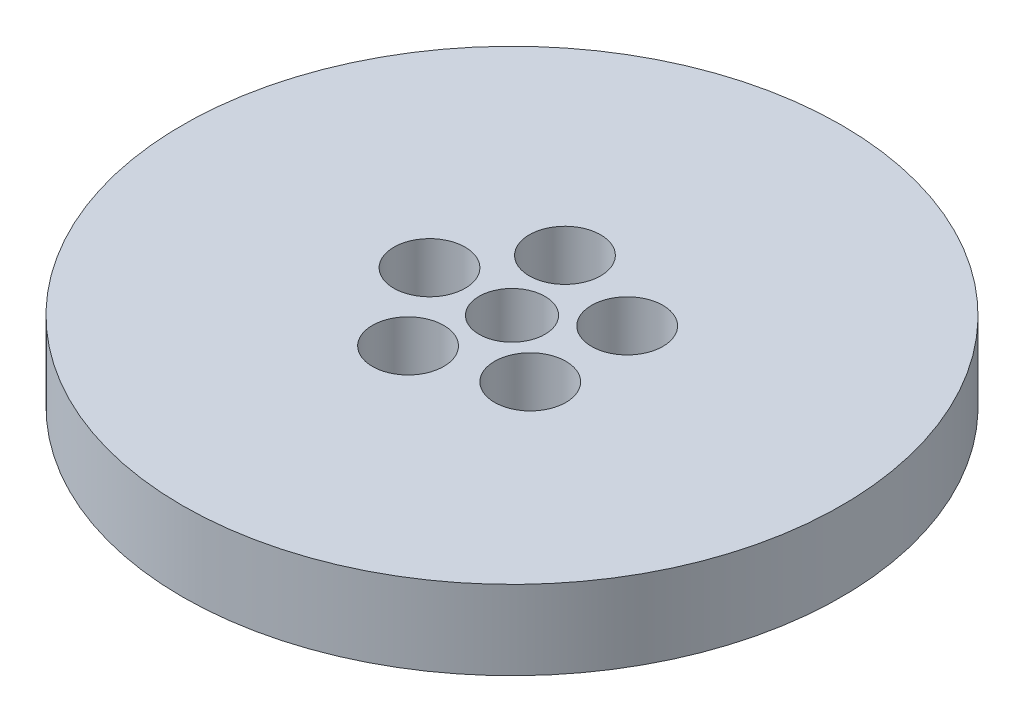
ISO-10303-21;
HEADER;
FILE_DESCRIPTION(('STEP AP214'),'2;1');
FILE_NAME('part.step','',(''),(''),'','','');
FILE_SCHEMA(('AUTOMOTIVE_DESIGN { 1 0 10303 214 1 1 1 1 }'));
ENDSEC;
DATA;
#1=APPLICATION_CONTEXT('core data for automotive mechanical design processes');
#2=APPLICATION_PROTOCOL_DEFINITION('international standard','automotive_design',2000,#1);
#3=PRODUCT_CONTEXT('',#1,'mechanical');
#4=PRODUCT('Part','Part','',(#3));
#5=PRODUCT_RELATED_PRODUCT_CATEGORY('part','',(#4));
#6=PRODUCT_DEFINITION_FORMATION('','',#4);
#7=PRODUCT_DEFINITION_CONTEXT('part definition',#1,'design');
#8=PRODUCT_DEFINITION('design','',#6,#7);
#9=PRODUCT_DEFINITION_SHAPE('','',#8);
#10=(LENGTH_UNIT() NAMED_UNIT(*) SI_UNIT(.MILLI.,.METRE.));
#11=(NAMED_UNIT(*) PLANE_ANGLE_UNIT() SI_UNIT($,.RADIAN.));
#12=(NAMED_UNIT(*) SI_UNIT($,.STERADIAN.) SOLID_ANGLE_UNIT());
#13=UNCERTAINTY_MEASURE_WITH_UNIT(LENGTH_MEASURE(1.E-05),#10,'distance_accuracy_value','');
#14=(GEOMETRIC_REPRESENTATION_CONTEXT(3) GLOBAL_UNCERTAINTY_ASSIGNED_CONTEXT((#13)) GLOBAL_UNIT_ASSIGNED_CONTEXT((#10,
#11,#12)) REPRESENTATION_CONTEXT('',''));
#15=CARTESIAN_POINT('',(0.,0.,0.));
#16=DIRECTION('',(0.,0.,1.));
#17=DIRECTION('',(1.,0.,0.));
#18=AXIS2_PLACEMENT_3D('',#15,#16,#17);
#19=CARTESIAN_POINT('',(0.,12.,0.));
#20=DIRECTION('',(0.,-1.,0.));
#21=DIRECTION('',(0.,0.,-1.));
#22=AXIS2_PLACEMENT_3D('',#19,#20,#21);
#23=CYLINDRICAL_SURFACE('',#22,50.);
#24=CARTESIAN_POINT('',(0.,12.,0.));
#25=DIRECTION('',(0.,1.,0.));
#26=DIRECTION('',(0.,0.,1.));
#27=AXIS2_PLACEMENT_3D('',#24,#25,#26);
#28=CIRCLE('',#27,50.);
#29=CARTESIAN_POINT('',(0.,12.,50.));
#30=VERTEX_POINT('',#29);
#31=EDGE_CURVE('E10',#30,#30,#28,.T.);
#32=ORIENTED_EDGE('',*,*,#31,.F.);
#33=EDGE_LOOP('',(#32));
#34=FACE_BOUND('',#33,.T.);
#35=CARTESIAN_POINT('',(0.,0.,0.));
#36=DIRECTION('',(0.,1.,0.));
#37=DIRECTION('',(0.,0.,1.));
#38=AXIS2_PLACEMENT_3D('',#35,#36,#37);
#39=CIRCLE('',#38,50.);
#40=CARTESIAN_POINT('',(0.,0.,50.));
#41=VERTEX_POINT('',#40);
#42=EDGE_CURVE('E37',#41,#41,#39,.T.);
#43=ORIENTED_EDGE('',*,*,#42,.T.);
#44=EDGE_LOOP('',(#43));
#45=FACE_BOUND('',#44,.T.);
#46=ADVANCED_FACE('F40',(#34,#45),#23,.T.);
#47=CARTESIAN_POINT('',(0.,12.,0.));
#48=DIRECTION('',(0.,1.,0.));
#49=DIRECTION('',(0.,0.,1.));
#50=AXIS2_PLACEMENT_3D('',#47,#48,#49);
#51=PLANE('',#50);
#52=CARTESIAN_POINT('',(-3.86702150883094,12.,-11.9014684356311));
#53=DIRECTION('',(0.,1.,0.));
#54=DIRECTION('',(-0.95105651629515,0.,0.309016994374958));
#55=AXIS2_PLACEMENT_3D('',#52,#53,#54);
#56=CIRCLE('',#55,5.41006252637511);
#57=CARTESIAN_POINT('',(-9.01229672810419,12.,-10.2296671743501));
#58=VERTEX_POINT('',#57);
#59=EDGE_CURVE('E70',#58,#58,#56,.T.);
#60=ORIENTED_EDGE('',*,*,#59,.F.);
#61=EDGE_LOOP('',(#60));
#62=FACE_BOUND('',#61,.T.);
#63=CARTESIAN_POINT('',(10.1239937453459,12.,-7.3555120092542));
#64=DIRECTION('',(0.,1.,0.));
#65=DIRECTION('',(-0.58778525229248,0.,-0.809016994374942));
#66=AXIS2_PLACEMENT_3D('',#63,#64,#65);
#67=CIRCLE('',#66,5.41006252637511);
#68=CARTESIAN_POINT('',(6.9440387783624,12.,-11.7323445337227));
#69=VERTEX_POINT('',#68);
#70=EDGE_CURVE('E71',#69,#69,#67,.T.);
#71=ORIENTED_EDGE('',*,*,#70,.F.);
#72=EDGE_LOOP('',(#71));
#73=FACE_BOUND('',#72,.T.);
#74=CARTESIAN_POINT('',(10.123993745346,12.,7.35551200925405));
#75=DIRECTION('',(0.,1.,0.));
#76=DIRECTION('',(0.587785252292469,0.,-0.809016994374951));
#77=AXIS2_PLACEMENT_3D('',#74,#75,#76);
#78=CIRCLE('',#77,5.41006252637511);
#79=CARTESIAN_POINT('',(13.3039487123294,12.,2.97867948478551));
#80=VERTEX_POINT('',#79);
#81=EDGE_CURVE('E78',#80,#80,#78,.T.);
#82=ORIENTED_EDGE('',*,*,#81,.F.);
#83=EDGE_LOOP('',(#82));
#84=FACE_BOUND('',#83,.T.);
#85=CARTESIAN_POINT('',(-3.86702150883077,12.,11.9014684356312));
#86=DIRECTION('',(0.,1.,0.));
#87=DIRECTION('',(0.951056516295155,0.,0.309016994374945));
#88=AXIS2_PLACEMENT_3D('',#85,#86,#87);
#89=CIRCLE('',#88,5.41006252637511);
#90=CARTESIAN_POINT('',(1.2782537104425,12.,13.5732696969122));
#91=VERTEX_POINT('',#90);
#92=EDGE_CURVE('E61',#91,#91,#89,.T.);
#93=ORIENTED_EDGE('',*,*,#92,.F.);
#94=EDGE_LOOP('',(#93));
#95=FACE_BOUND('',#94,.T.);
#96=CARTESIAN_POINT('',(-12.5139444730303,12.,0.));
#97=DIRECTION('',(0.,1.,0.));
#98=DIRECTION('',(0.,0.,1.));
#99=AXIS2_PLACEMENT_3D('',#96,#97,#98);
#100=CIRCLE('',#99,5.41006252637511);
#101=CARTESIAN_POINT('',(-12.5139444730303,12.,5.41006252637511));
#102=VERTEX_POINT('',#101);
#103=EDGE_CURVE('E54',#102,#102,#100,.T.);
#104=ORIENTED_EDGE('',*,*,#103,.F.);
#105=EDGE_LOOP('',(#104));
#106=FACE_BOUND('',#105,.T.);
#107=CARTESIAN_POINT('',(0.,12.,0.));
#108=DIRECTION('',(0.,1.,0.));
#109=DIRECTION('',(0.,0.,1.));
#110=AXIS2_PLACEMENT_3D('',#107,#108,#109);
#111=CIRCLE('',#110,5.);
#112=CARTESIAN_POINT('',(0.,12.,5.));
#113=VERTEX_POINT('',#112);
#114=EDGE_CURVE('E50',#113,#113,#111,.T.);
#115=ORIENTED_EDGE('',*,*,#114,.F.);
#116=EDGE_LOOP('',(#115));
#117=FACE_BOUND('',#116,.T.);
#118=ORIENTED_EDGE('',*,*,#31,.T.);
#119=EDGE_LOOP('',(#118));
#120=FACE_BOUND('',#119,.T.);
#121=ADVANCED_FACE('F94',(#62,#73,#84,#95,#106,#117,#120),#51,.T.);
#122=CARTESIAN_POINT('',(0.,0.,0.));
#123=DIRECTION('',(0.,1.,0.));
#124=DIRECTION('',(0.,0.,1.));
#125=AXIS2_PLACEMENT_3D('',#122,#123,#124);
#126=PLANE('',#125);
#127=CARTESIAN_POINT('',(0.,0.,0.));
#128=DIRECTION('',(0.,1.,0.));
#129=DIRECTION('',(0.,0.,1.));
#130=AXIS2_PLACEMENT_3D('',#127,#128,#129);
#131=CIRCLE('',#130,5.);
#132=CARTESIAN_POINT('',(0.,0.,5.));
#133=VERTEX_POINT('',#132);
#134=EDGE_CURVE('E47',#133,#133,#131,.T.);
#135=ORIENTED_EDGE('',*,*,#134,.T.);
#136=EDGE_LOOP('',(#135));
#137=FACE_BOUND('',#136,.T.);
#138=ORIENTED_EDGE('',*,*,#42,.F.);
#139=EDGE_LOOP('',(#138));
#140=FACE_BOUND('',#139,.T.);
#141=ADVANCED_FACE('F100',(#137,#140),#126,.F.);
#142=CARTESIAN_POINT('',(0.,12.,0.));
#143=DIRECTION('',(0.,-1.,0.));
#144=DIRECTION('',(0.,0.,-1.));
#145=AXIS2_PLACEMENT_3D('',#142,#143,#144);
#146=CYLINDRICAL_SURFACE('',#145,5.);
#147=ORIENTED_EDGE('',*,*,#114,.T.);
#148=EDGE_LOOP('',(#147));
#149=FACE_BOUND('',#148,.T.);
#150=ORIENTED_EDGE('',*,*,#134,.F.);
#151=EDGE_LOOP('',(#150));
#152=FACE_BOUND('',#151,.T.);
#153=ADVANCED_FACE('F106',(#149,#152),#146,.F.);
#154=CARTESIAN_POINT('',(-12.5139444730303,0.200881773480436,0.));
#155=DIRECTION('',(0.,1.,0.));
#156=DIRECTION('',(0.,0.,1.));
#157=AXIS2_PLACEMENT_3D('',#154,#155,#156);
#158=CYLINDRICAL_SURFACE('',#157,5.41006252637511);
#159=CARTESIAN_POINT('',(-12.5139444730303,0.200881773480436,0.));
#160=DIRECTION('',(0.,1.,0.));
#161=DIRECTION('',(0.,0.,1.));
#162=AXIS2_PLACEMENT_3D('',#159,#160,#161);
#163=CIRCLE('',#162,5.41006252637511);
#164=CARTESIAN_POINT('',(-12.5139444730303,0.200881773480436,5.41006252637511));
#165=VERTEX_POINT('',#164);
#166=EDGE_CURVE('E55',#165,#165,#163,.T.);
#167=ORIENTED_EDGE('',*,*,#166,.F.);
#168=EDGE_LOOP('',(#167));
#169=FACE_BOUND('',#168,.T.);
#170=ORIENTED_EDGE('',*,*,#103,.T.);
#171=EDGE_LOOP('',(#170));
#172=FACE_BOUND('',#171,.T.);
#173=ADVANCED_FACE('F108',(#169,#172),#158,.F.);
#174=CARTESIAN_POINT('',(-12.5139444730303,0.200881773480436,0.));
#175=DIRECTION('',(0.,1.,0.));
#176=DIRECTION('',(0.,0.,1.));
#177=AXIS2_PLACEMENT_3D('',#174,#175,#176);
#178=PLANE('',#177);
#179=ORIENTED_EDGE('',*,*,#166,.T.);
#180=EDGE_LOOP('',(#179));
#181=FACE_BOUND('',#180,.T.);
#182=ADVANCED_FACE('F138',(#181),#178,.T.);
#183=CARTESIAN_POINT('',(-3.86702150883077,0.200881773480436,11.9014684356312));
#184=DIRECTION('',(0.,1.,0.));
#185=DIRECTION('',(0.,0.,1.));
#186=AXIS2_PLACEMENT_3D('',#183,#184,#185);
#187=CYLINDRICAL_SURFACE('',#186,5.41006252637511);
#188=CARTESIAN_POINT('',(-3.86702150883077,0.200881773480436,11.9014684356312));
#189=DIRECTION('',(0.,1.,0.));
#190=DIRECTION('',(0.951056516295155,0.,0.309016994374945));
#191=AXIS2_PLACEMENT_3D('',#188,#189,#190);
#192=CIRCLE('',#191,5.41006252637511);
#193=CARTESIAN_POINT('',(1.2782537104425,0.200881773480436,13.5732696969122));
#194=VERTEX_POINT('',#193);
#195=EDGE_CURVE('E59',#194,#194,#192,.T.);
#196=ORIENTED_EDGE('',*,*,#195,.F.);
#197=EDGE_LOOP('',(#196));
#198=FACE_BOUND('',#197,.T.);
#199=ORIENTED_EDGE('',*,*,#92,.T.);
#200=EDGE_LOOP('',(#199));
#201=FACE_BOUND('',#200,.T.);
#202=ADVANCED_FACE('F150',(#198,#201),#187,.F.);
#203=CARTESIAN_POINT('',(-3.86702150883077,0.200881773480436,11.9014684356312));
#204=DIRECTION('',(0.,1.,0.));
#205=DIRECTION('',(0.951056516295155,0.,0.309016994374945));
#206=AXIS2_PLACEMENT_3D('',#203,#204,#205);
#207=PLANE('',#206);
#208=ORIENTED_EDGE('',*,*,#195,.T.);
#209=EDGE_LOOP('',(#208));
#210=FACE_BOUND('',#209,.T.);
#211=ADVANCED_FACE('F89',(#210),#207,.T.);
#212=CARTESIAN_POINT('',(10.123993745346,0.200881773480436,7.35551200925405));
#213=DIRECTION('',(0.,1.,0.));
#214=DIRECTION('',(0.,0.,1.));
#215=AXIS2_PLACEMENT_3D('',#212,#213,#214);
#216=CYLINDRICAL_SURFACE('',#215,5.41006252637511);
#217=CARTESIAN_POINT('',(10.123993745346,0.200881773480436,7.35551200925405));
#218=DIRECTION('',(0.,1.,0.));
#219=DIRECTION('',(0.587785252292469,0.,-0.809016994374951));
#220=AXIS2_PLACEMENT_3D('',#217,#218,#219);
#221=CIRCLE('',#220,5.41006252637511);
#222=CARTESIAN_POINT('',(13.3039487123294,0.200881773480436,2.97867948478551));
#223=VERTEX_POINT('',#222);
#224=EDGE_CURVE('E63',#223,#223,#221,.T.);
#225=ORIENTED_EDGE('',*,*,#224,.F.);
#226=EDGE_LOOP('',(#225));
#227=FACE_BOUND('',#226,.T.);
#228=ORIENTED_EDGE('',*,*,#81,.T.);
#229=EDGE_LOOP('',(#228));
#230=FACE_BOUND('',#229,.T.);
#231=ADVANCED_FACE('F87',(#227,#230),#216,.F.);
#232=CARTESIAN_POINT('',(10.123993745346,0.200881773480436,7.35551200925405));
#233=DIRECTION('',(0.,1.,0.));
#234=DIRECTION('',(0.587785252292469,0.,-0.809016994374951));
#235=AXIS2_PLACEMENT_3D('',#232,#233,#234);
#236=PLANE('',#235);
#237=ORIENTED_EDGE('',*,*,#224,.T.);
#238=EDGE_LOOP('',(#237));
#239=FACE_BOUND('',#238,.T.);
#240=ADVANCED_FACE('F84',(#239),#236,.T.);
#241=CARTESIAN_POINT('',(10.1239937453459,0.200881773480436,-7.3555120092542));
#242=DIRECTION('',(0.,1.,0.));
#243=DIRECTION('',(0.,0.,1.));
#244=AXIS2_PLACEMENT_3D('',#241,#242,#243);
#245=CYLINDRICAL_SURFACE('',#244,5.41006252637511);
#246=CARTESIAN_POINT('',(10.1239937453459,0.200881773480436,-7.3555120092542));
#247=DIRECTION('',(0.,1.,0.));
#248=DIRECTION('',(-0.58778525229248,0.,-0.809016994374942));
#249=AXIS2_PLACEMENT_3D('',#246,#247,#248);
#250=CIRCLE('',#249,5.41006252637511);
#251=CARTESIAN_POINT('',(6.9440387783624,0.200881773480436,-11.7323445337227));
#252=VERTEX_POINT('',#251);
#253=EDGE_CURVE('E76',#252,#252,#250,.T.);
#254=ORIENTED_EDGE('',*,*,#253,.F.);
#255=EDGE_LOOP('',(#254));
#256=FACE_BOUND('',#255,.T.);
#257=ORIENTED_EDGE('',*,*,#70,.T.);
#258=EDGE_LOOP('',(#257));
#259=FACE_BOUND('',#258,.T.);
#260=ADVANCED_FACE('F185',(#256,#259),#245,.F.);
#261=CARTESIAN_POINT('',(10.1239937453459,0.200881773480436,-7.3555120092542));
#262=DIRECTION('',(0.,1.,0.));
#263=DIRECTION('',(-0.58778525229248,0.,-0.809016994374942));
#264=AXIS2_PLACEMENT_3D('',#261,#262,#263);
#265=PLANE('',#264);
#266=ORIENTED_EDGE('',*,*,#253,.T.);
#267=EDGE_LOOP('',(#266));
#268=FACE_BOUND('',#267,.T.);
#269=ADVANCED_FACE('F189',(#268),#265,.T.);
#270=CARTESIAN_POINT('',(-3.86702150883094,0.200881773480436,-11.9014684356311));
#271=DIRECTION('',(0.,1.,0.));
#272=DIRECTION('',(0.,0.,1.));
#273=AXIS2_PLACEMENT_3D('',#270,#271,#272);
#274=CYLINDRICAL_SURFACE('',#273,5.41006252637511);
#275=CARTESIAN_POINT('',(-3.86702150883094,0.200881773480436,-11.9014684356311));
#276=DIRECTION('',(0.,1.,0.));
#277=DIRECTION('',(-0.95105651629515,0.,0.309016994374958));
#278=AXIS2_PLACEMENT_3D('',#275,#276,#277);
#279=CIRCLE('',#278,5.41006252637511);
#280=CARTESIAN_POINT('',(-9.01229672810419,0.200881773480436,-10.2296671743501));
#281=VERTEX_POINT('',#280);
#282=EDGE_CURVE('E69',#281,#281,#279,.T.);
#283=ORIENTED_EDGE('',*,*,#282,.F.);
#284=EDGE_LOOP('',(#283));
#285=FACE_BOUND('',#284,.T.);
#286=ORIENTED_EDGE('',*,*,#59,.T.);
#287=EDGE_LOOP('',(#286));
#288=FACE_BOUND('',#287,.T.);
#289=ADVANCED_FACE('F200',(#285,#288),#274,.F.);
#290=CARTESIAN_POINT('',(-3.86702150883094,0.200881773480436,-11.9014684356311));
#291=DIRECTION('',(0.,1.,0.));
#292=DIRECTION('',(-0.95105651629515,0.,0.309016994374958));
#293=AXIS2_PLACEMENT_3D('',#290,#291,#292);
#294=PLANE('',#293);
#295=ORIENTED_EDGE('',*,*,#282,.T.);
#296=EDGE_LOOP('',(#295));
#297=FACE_BOUND('',#296,.T.);
#298=ADVANCED_FACE('F208',(#297),#294,.T.);
#299=CLOSED_SHELL('',(#46,#121,#141,#153,#173,#182,#202,#211,#231,#240,#260,#269,#289,#298));
#300=MANIFOLD_SOLID_BREP('B2',#299);
#301=ADVANCED_BREP_SHAPE_REPRESENTATION('',(#18,#300),#14);
#302=SHAPE_DEFINITION_REPRESENTATION(#9,#301);
ENDSEC;
END-ISO-10303-21;
